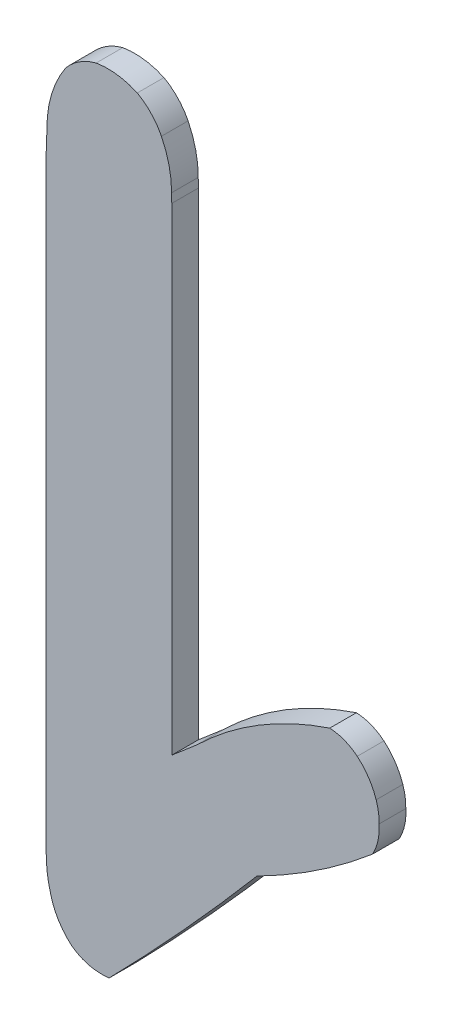
ISO-10303-21;
HEADER;
FILE_DESCRIPTION(('STEP AP214'),'2;1');
FILE_NAME('part.step','',(''),(''),'','','');
FILE_SCHEMA(('AUTOMOTIVE_DESIGN { 1 0 10303 214 1 1 1 1 }'));
ENDSEC;
DATA;
#1=APPLICATION_CONTEXT('core data for automotive mechanical design processes');
#2=APPLICATION_PROTOCOL_DEFINITION('international standard','automotive_design',2000,#1);
#3=PRODUCT_CONTEXT('',#1,'mechanical');
#4=PRODUCT('Part','Part','',(#3));
#5=PRODUCT_RELATED_PRODUCT_CATEGORY('part','',(#4));
#6=PRODUCT_DEFINITION_FORMATION('','',#4);
#7=PRODUCT_DEFINITION_CONTEXT('part definition',#1,'design');
#8=PRODUCT_DEFINITION('design','',#6,#7);
#9=PRODUCT_DEFINITION_SHAPE('','',#8);
#10=(LENGTH_UNIT() NAMED_UNIT(*) SI_UNIT(.MILLI.,.METRE.));
#11=(NAMED_UNIT(*) PLANE_ANGLE_UNIT() SI_UNIT($,.RADIAN.));
#12=(NAMED_UNIT(*) SI_UNIT($,.STERADIAN.) SOLID_ANGLE_UNIT());
#13=UNCERTAINTY_MEASURE_WITH_UNIT(LENGTH_MEASURE(1.E-05),#10,'distance_accuracy_value','');
#14=(GEOMETRIC_REPRESENTATION_CONTEXT(3) GLOBAL_UNCERTAINTY_ASSIGNED_CONTEXT((#13)) GLOBAL_UNIT_ASSIGNED_CONTEXT((#10,
#11,#12)) REPRESENTATION_CONTEXT('',''));
#15=CARTESIAN_POINT('',(0.,0.,0.));
#16=DIRECTION('',(0.,0.,1.));
#17=DIRECTION('',(1.,0.,0.));
#18=AXIS2_PLACEMENT_3D('',#15,#16,#17);
#19=CARTESIAN_POINT('',(-1.32356817484343,-3.51440228783204,0.));
#20=DIRECTION('',(0.,0.,1.));
#21=DIRECTION('',(1.,0.,0.));
#22=AXIS2_PLACEMENT_3D('',#19,#20,#21);
#23=PLANE('',#22);
#24=CARTESIAN_POINT('',(-1.26243654567526,-3.4652377303043,0.));
#25=DIRECTION('',(0.,0.,-1.));
#26=DIRECTION('',(-1.,0.,0.));
#27=AXIS2_PLACEMENT_3D('',#24,#25,#26);
#28=CIRCLE('',#27,0.308146895503402);
#29=CARTESIAN_POINT('',(-1.56203909572244,-3.53729896269462,0.));
#30=VERTEX_POINT('',#29);
#31=CARTESIAN_POINT('',(-1.46146840128563,-3.70048404730135,0.));
#32=VERTEX_POINT('',#31);
#33=EDGE_CURVE('E158',#30,#32,#28,.F.);
#34=ORIENTED_EDGE('',*,*,#33,.F.);
#35=CARTESIAN_POINT('',(-1.05112893558023,-3.38954688872619,0.));
#36=DIRECTION('',(0.,0.,-1.));
#37=DIRECTION('',(-1.,0.,0.));
#38=AXIS2_PLACEMENT_3D('',#35,#36,#37);
#39=CIRCLE('',#38,0.531845717382881);
#40=CARTESIAN_POINT('',(-1.58286365579994,-3.40041217341562,0.));
#41=VERTEX_POINT('',#40);
#42=EDGE_CURVE('E20',#41,#30,#39,.F.);
#43=ORIENTED_EDGE('',*,*,#42,.F.);
#44=DIRECTION('',(0.0222427276221201,-0.999752599930567,0.));
#45=VECTOR('',#44,1.);
#46=CARTESIAN_POINT('',(-1.58373134580317,-3.36141177061429,0.));
#47=LINE('',#46,#45);
#48=CARTESIAN_POINT('',(-1.58373134580317,-3.36141177061427,0.));
#49=VERTEX_POINT('',#48);
#50=EDGE_CURVE('E151',#49,#41,#47,.T.);
#51=ORIENTED_EDGE('',*,*,#50,.F.);
#52=DIRECTION('',(0.,1.,0.));
#53=VECTOR('',#52,1.);
#54=CARTESIAN_POINT('',(-1.58373134580317,-0.502050222938383,0.));
#55=LINE('',#54,#53);
#56=CARTESIAN_POINT('',(-1.58373134580317,-0.502050222938383,0.));
#57=VERTEX_POINT('',#56);
#58=EDGE_CURVE('E304',#49,#57,#55,.T.);
#59=ORIENTED_EDGE('',*,*,#58,.T.);
#60=DIRECTION('',(0.0352404784521863,0.999378861432671,0.));
#61=VECTOR('',#60,1.);
#62=CARTESIAN_POINT('',(-1.58001654797684,-0.396702889837854,0.));
#63=LINE('',#62,#61);
#64=CARTESIAN_POINT('',(-1.58001654797684,-0.396702889837914,0.));
#65=VERTEX_POINT('',#64);
#66=EDGE_CURVE('E294',#57,#65,#63,.T.);
#67=ORIENTED_EDGE('',*,*,#66,.T.);
#68=CARTESIAN_POINT('',(-1.05969997054757,-0.390570609215359,0.));
#69=DIRECTION('',(0.,0.,-1.));
#70=DIRECTION('',(-1.,0.,0.));
#71=AXIS2_PLACEMENT_3D('',#68,#69,#70);
#72=CIRCLE('',#71,0.520352712699135);
#73=CARTESIAN_POINT('',(-1.49086140014506,-0.099251596377554,0.));
#74=VERTEX_POINT('',#73);
#75=EDGE_CURVE('E218',#74,#65,#72,.F.);
#76=ORIENTED_EDGE('',*,*,#75,.F.);
#77=CARTESIAN_POINT('',(-1.27504675214731,-0.2762404123147,0.));
#78=DIRECTION('',(0.,0.,-1.));
#79=DIRECTION('',(-1.,0.,0.));
#80=AXIS2_PLACEMENT_3D('',#77,#78,#79);
#81=CIRCLE('',#80,0.279107512004293);
#82=CARTESIAN_POINT('',(-1.34598428491839,-0.0062980671711876,0.));
#83=VERTEX_POINT('',#82);
#84=EDGE_CURVE('E214',#83,#74,#81,.F.);
#85=ORIENTED_EDGE('',*,*,#84,.F.);
#86=CARTESIAN_POINT('',(-1.2899730389366,-0.341552658756156,0.));
#87=DIRECTION('',(0.,0.,-1.));
#88=DIRECTION('',(-1.,0.,0.));
#89=AXIS2_PLACEMENT_3D('',#86,#87,#88);
#90=CIRCLE('',#89,0.339901310464135);
#91=CARTESIAN_POINT('',(-1.15023884325242,-0.0317022829104376,0.));
#92=VERTEX_POINT('',#91);
#93=EDGE_CURVE('E210',#92,#83,#90,.F.);
#94=ORIENTED_EDGE('',*,*,#93,.F.);
#95=CARTESIAN_POINT('',(-1.29058517764166,-0.279608394921192,0.));
#96=DIRECTION('',(0.,0.,-1.));
#97=DIRECTION('',(-1.,0.,0.));
#98=AXIS2_PLACEMENT_3D('',#95,#96,#97);
#99=CIRCLE('',#98,0.28487634852473);
#100=CARTESIAN_POINT('',(-1.03548684032537,-0.152803930302439,0.));
#101=VERTEX_POINT('',#100);
#102=EDGE_CURVE('E206',#101,#92,#99,.F.);
#103=ORIENTED_EDGE('',*,*,#102,.F.);
#104=CARTESIAN_POINT('',(-1.44912356324474,-0.358154523340133,0.));
#105=DIRECTION('',(0.,0.,-1.));
#106=DIRECTION('',(-1.,0.,0.));
#107=AXIS2_PLACEMENT_3D('',#104,#105,#106);
#108=CIRCLE('',#107,0.461805375248499);
#109=CARTESIAN_POINT('',(-0.987330045146156,-0.361463790712253,0.));
#110=VERTEX_POINT('',#109);
#111=EDGE_CURVE('E201',#110,#101,#108,.F.);
#112=ORIENTED_EDGE('',*,*,#111,.F.);
#113=DIRECTION('',(0.0232210854174442,-0.9997303542416,0.));
#114=VECTOR('',#113,1.);
#115=CARTESIAN_POINT('',(-0.986326778579924,-0.40465712218785,0.));
#116=LINE('',#115,#114);
#117=CARTESIAN_POINT('',(-0.986326778579924,-0.40465712218785,0.));
#118=VERTEX_POINT('',#117);
#119=EDGE_CURVE('E205',#110,#118,#116,.T.);
#120=ORIENTED_EDGE('',*,*,#119,.T.);
#121=DIRECTION('',(0.,1.,0.));
#122=VECTOR('',#121,1.);
#123=CARTESIAN_POINT('',(-0.986326778579924,-2.67716280636695,0.));
#124=LINE('',#123,#122);
#125=CARTESIAN_POINT('',(-0.986326778579923,-2.67716280636695,0.));
#126=VERTEX_POINT('',#125);
#127=EDGE_CURVE('E284',#118,#126,#124,.F.);
#128=ORIENTED_EDGE('',*,*,#127,.T.);
#129=DIRECTION('',(0.7598856857632,0.650056724118897,0.));
#130=VECTOR('',#129,1.);
#131=CARTESIAN_POINT('',(-0.866856711260316,-2.57496016977689,0.));
#132=LINE('',#131,#130);
#133=CARTESIAN_POINT('',(-0.866856711260372,-2.57496016977694,0.));
#134=VERTEX_POINT('',#133);
#135=EDGE_CURVE('E277',#126,#134,#132,.T.);
#136=ORIENTED_EDGE('',*,*,#135,.T.);
#137=CARTESIAN_POINT('',(0.287744797252366,-3.75960348997238,0.));
#138=DIRECTION('',(0.,0.,-1.));
#139=DIRECTION('',(-1.,0.,0.));
#140=AXIS2_PLACEMENT_3D('',#137,#138,#139);
#141=CIRCLE('',#140,1.65423228101243);
#142=CARTESIAN_POINT('',(-0.23517838890952,-2.19019730261428,0.));
#143=VERTEX_POINT('',#142);
#144=EDGE_CURVE('E198',#143,#134,#141,.F.);
#145=ORIENTED_EDGE('',*,*,#144,.F.);
#146=CARTESIAN_POINT('',(-0.244954041898298,-2.40999829922092,0.));
#147=DIRECTION('',(0.,0.,-1.));
#148=DIRECTION('',(-1.,0.,0.));
#149=AXIS2_PLACEMENT_3D('',#146,#147,#148);
#150=CIRCLE('',#149,0.220018275378727);
#151=CARTESIAN_POINT('',(-0.104306317350756,-2.24080533518214,0.));
#152=VERTEX_POINT('',#151);
#153=EDGE_CURVE('E194',#152,#143,#150,.F.);
#154=ORIENTED_EDGE('',*,*,#153,.F.);
#155=CARTESIAN_POINT('',(-0.296636754984562,-2.46721642458803,0.));
#156=DIRECTION('',(0.,0.,-1.));
#157=DIRECTION('',(-1.,0.,0.));
#158=AXIS2_PLACEMENT_3D('',#155,#156,#157);
#159=CIRCLE('',#158,0.29707402889915);
#160=CARTESIAN_POINT('',(-0.014269934296841,-2.37490197706717,0.));
#161=VERTEX_POINT('',#160);
#162=EDGE_CURVE('E190',#161,#152,#159,.F.);
#163=ORIENTED_EDGE('',*,*,#162,.F.);
#164=CARTESIAN_POINT('',(-0.265408994429866,-2.46050758309895,0.));
#165=DIRECTION('',(0.,0.,-1.));
#166=DIRECTION('',(-1.,0.,0.));
#167=AXIS2_PLACEMENT_3D('',#164,#165,#166);
#168=CIRCLE('',#167,0.265328376372688);
#169=CARTESIAN_POINT('',(-0.000169974597434634,-2.46739305090425,0.));
#170=VERTEX_POINT('',#169);
#171=EDGE_CURVE('E186',#170,#161,#168,.F.);
#172=ORIENTED_EDGE('',*,*,#171,.F.);
#173=CARTESIAN_POINT('',(-0.252085028566188,-2.48453586144662,0.));
#174=DIRECTION('',(0.,0.,-1.));
#175=DIRECTION('',(-1.,0.,0.));
#176=AXIS2_PLACEMENT_3D('',#173,#174,#175);
#177=CIRCLE('',#176,0.252497664086961);
#178=CARTESIAN_POINT('',(-0.0314068147136812,-2.60723955454605,0.));
#179=VERTEX_POINT('',#178);
#180=EDGE_CURVE('E182',#179,#170,#177,.F.);
#181=ORIENTED_EDGE('',*,*,#180,.F.);
#182=CARTESIAN_POINT('',(-1.83264567859815,-0.491581808421703,0.));
#183=DIRECTION('',(0.,0.,-1.));
#184=DIRECTION('',(-1.,0.,0.));
#185=AXIS2_PLACEMENT_3D('',#182,#183,#184);
#186=CIRCLE('',#185,2.77857322082823);
#187=CARTESIAN_POINT('',(-0.581047758790502,-2.97230182298137,0.));
#188=VERTEX_POINT('',#187);
#189=EDGE_CURVE('E178',#188,#179,#186,.F.);
#190=ORIENTED_EDGE('',*,*,#189,.F.);
#191=CARTESIAN_POINT('',(-11.9325819547259,6.66693556379146,0.));
#192=DIRECTION('',(0.,0.,-1.));
#193=DIRECTION('',(-1.,0.,0.));
#194=AXIS2_PLACEMENT_3D('',#191,#192,#193);
#195=CIRCLE('',#194,14.8920188691812);
#196=CARTESIAN_POINT('',(-1.28413425687579,-3.7437698698571,0.));
#197=VERTEX_POINT('',#196);
#198=EDGE_CURVE('E173',#197,#188,#195,.F.);
#199=ORIENTED_EDGE('',*,*,#198,.F.);
#200=DIRECTION('',(-0.996718292328276,-0.0809484140561453,0.));
#201=VECTOR('',#200,1.);
#202=CARTESIAN_POINT('',(-1.304633433202,-3.74543470918618,0.));
#203=LINE('',#202,#201);
#204=CARTESIAN_POINT('',(-1.304633433202,-3.74543470918618,0.));
#205=VERTEX_POINT('',#204);
#206=EDGE_CURVE('E177',#197,#205,#203,.T.);
#207=ORIENTED_EDGE('',*,*,#206,.T.);
#208=DIRECTION('',(-0.999685617936159,-0.0250731986710944,0.));
#209=VECTOR('',#208,1.);
#210=CARTESIAN_POINT('',(-1.32675952828435,-3.7459896556292,0.));
#211=LINE('',#210,#209);
#212=CARTESIAN_POINT('',(-1.32675952828446,-3.7459896556292,0.));
#213=VERTEX_POINT('',#212);
#214=EDGE_CURVE('E268',#205,#213,#211,.T.);
#215=ORIENTED_EDGE('',*,*,#214,.T.);
#216=CARTESIAN_POINT('',(-1.32356817484343,-3.51440228783204,0.));
#217=DIRECTION('',(0.,0.,-1.));
#218=DIRECTION('',(-1.,0.,0.));
#219=AXIS2_PLACEMENT_3D('',#216,#217,#218);
#220=CIRCLE('',#219,0.231609355726417);
#221=EDGE_CURVE('E168',#32,#213,#220,.F.);
#222=ORIENTED_EDGE('',*,*,#221,.F.);
#223=EDGE_LOOP('',(#34,#43,#51,#59,#67,#76,#85,#94,#103,#112,#120,#128,#136,#145,#154,#163,#172,
#181,#190,#199,#207,#215,#222));
#224=FACE_BOUND('',#223,.T.);
#225=ADVANCED_FACE('F17',(#224),#23,.F.);
#226=CARTESIAN_POINT('',(-1.32356817484343,-3.51440228783204,0.12677429857786));
#227=DIRECTION('',(0.,0.,-1.));
#228=DIRECTION('',(-1.,0.,0.));
#229=AXIS2_PLACEMENT_3D('',#226,#227,#228);
#230=CYLINDRICAL_SURFACE('',#229,0.231609355726417);
#231=CARTESIAN_POINT('',(-1.32356817484343,-3.51440228783204,0.12677429857786));
#232=DIRECTION('',(0.,0.,-1.));
#233=DIRECTION('',(-1.,0.,0.));
#234=AXIS2_PLACEMENT_3D('',#231,#232,#233);
#235=CIRCLE('',#234,0.231609355726417);
#236=CARTESIAN_POINT('',(-1.46146840128563,-3.70048404730135,0.12677429857786));
#237=VERTEX_POINT('',#236);
#238=CARTESIAN_POINT('',(-1.32675952828446,-3.7459896556292,0.12677429857786));
#239=VERTEX_POINT('',#238);
#240=EDGE_CURVE('E164',#237,#239,#235,.F.);
#241=ORIENTED_EDGE('',*,*,#240,.F.);
#242=DIRECTION('',(0.,0.,-1.));
#243=VECTOR('',#242,1.);
#244=CARTESIAN_POINT('',(-1.46146840128567,-3.70048404730132,0.12677429857786));
#245=LINE('',#244,#243);
#246=EDGE_CURVE('E165',#32,#237,#245,.F.);
#247=ORIENTED_EDGE('',*,*,#246,.F.);
#248=ORIENTED_EDGE('',*,*,#221,.T.);
#249=DIRECTION('',(0.,0.,1.));
#250=VECTOR('',#249,1.);
#251=CARTESIAN_POINT('',(-1.32675952828435,-3.7459896556292,0.12677429857786));
#252=LINE('',#251,#250);
#253=EDGE_CURVE('E170',#213,#239,#252,.T.);
#254=ORIENTED_EDGE('',*,*,#253,.T.);
#255=EDGE_LOOP('',(#241,#247,#248,#254));
#256=FACE_BOUND('',#255,.T.);
#257=ADVANCED_FACE('F475',(#256),#230,.T.);
#258=CARTESIAN_POINT('',(-1.32675952828435,-3.7459896556292,0.12677429857786));
#259=DIRECTION('',(-0.0250731986710944,0.999685617936159,0.));
#260=DIRECTION('',(-0.999685617936159,-0.0250731986710944,0.));
#261=AXIS2_PLACEMENT_3D('',#258,#259,#260);
#262=PLANE('',#261);
#263=DIRECTION('',(0.,0.,1.));
#264=VECTOR('',#263,1.);
#265=CARTESIAN_POINT('',(-1.304633433202,-3.74543470918618,0.12677429857786));
#266=LINE('',#265,#264);
#267=CARTESIAN_POINT('',(-1.304633433202,-3.74543470918618,0.12677429857786));
#268=VERTEX_POINT('',#267);
#269=EDGE_CURVE('E270',#205,#268,#266,.T.);
#270=ORIENTED_EDGE('',*,*,#269,.T.);
#271=DIRECTION('',(0.999685617936163,0.025073198670949,0.));
#272=VECTOR('',#271,1.);
#273=CARTESIAN_POINT('',(-1.32675952828435,-3.7459896556292,0.12677429857786));
#274=LINE('',#273,#272);
#275=EDGE_CURVE('E223',#239,#268,#274,.T.);
#276=ORIENTED_EDGE('',*,*,#275,.F.);
#277=ORIENTED_EDGE('',*,*,#253,.F.);
#278=ORIENTED_EDGE('',*,*,#214,.F.);
#279=EDGE_LOOP('',(#270,#276,#277,#278));
#280=FACE_BOUND('',#279,.T.);
#281=ADVANCED_FACE('F473',(#280),#262,.F.);
#282=CARTESIAN_POINT('',(-1.304633433202,-3.74543470918618,0.12677429857786));
#283=DIRECTION('',(-0.0809484140561453,0.996718292328276,0.));
#284=DIRECTION('',(-0.996718292328276,-0.0809484140561453,0.));
#285=AXIS2_PLACEMENT_3D('',#282,#283,#284);
#286=PLANE('',#285);
#287=DIRECTION('',(0.,0.,-1.));
#288=VECTOR('',#287,1.);
#289=CARTESIAN_POINT('',(-1.28413425687576,-3.74376986985707,0.12677429857786));
#290=LINE('',#289,#288);
#291=CARTESIAN_POINT('',(-1.28413425687579,-3.7437698698571,0.12677429857786));
#292=VERTEX_POINT('',#291);
#293=EDGE_CURVE('E176',#292,#197,#290,.T.);
#294=ORIENTED_EDGE('',*,*,#293,.F.);
#295=DIRECTION('',(0.996718292328308,0.080948414055757,0.));
#296=VECTOR('',#295,1.);
#297=CARTESIAN_POINT('',(-1.304633433202,-3.74543470918618,0.12677429857786));
#298=LINE('',#297,#296);
#299=EDGE_CURVE('E228',#268,#292,#298,.T.);
#300=ORIENTED_EDGE('',*,*,#299,.F.);
#301=ORIENTED_EDGE('',*,*,#269,.F.);
#302=ORIENTED_EDGE('',*,*,#206,.F.);
#303=EDGE_LOOP('',(#294,#300,#301,#302));
#304=FACE_BOUND('',#303,.T.);
#305=ADVANCED_FACE('F468',(#304),#286,.F.);
#306=CARTESIAN_POINT('',(-11.9325819547259,6.66693556379146,0.12677429857786));
#307=DIRECTION('',(0.,0.,-1.));
#308=DIRECTION('',(-1.,0.,0.));
#309=AXIS2_PLACEMENT_3D('',#306,#307,#308);
#310=CYLINDRICAL_SURFACE('',#309,14.8920188691812);
#311=CARTESIAN_POINT('',(-11.9325819547259,6.66693556379146,0.12677429857786));
#312=DIRECTION('',(0.,0.,-1.));
#313=DIRECTION('',(-1.,0.,0.));
#314=AXIS2_PLACEMENT_3D('',#311,#312,#313);
#315=CIRCLE('',#314,14.8920188691812);
#316=CARTESIAN_POINT('',(-0.581047758790502,-2.97230182298137,0.12677429857786));
#317=VERTEX_POINT('',#316);
#318=EDGE_CURVE('E224',#292,#317,#315,.F.);
#319=ORIENTED_EDGE('',*,*,#318,.F.);
#320=ORIENTED_EDGE('',*,*,#293,.T.);
#321=ORIENTED_EDGE('',*,*,#198,.T.);
#322=DIRECTION('',(0.,0.,-1.));
#323=VECTOR('',#322,1.);
#324=CARTESIAN_POINT('',(-0.581047758790427,-2.97230182298134,0.12677429857786));
#325=LINE('',#324,#323);
#326=EDGE_CURVE('E181',#317,#188,#325,.T.);
#327=ORIENTED_EDGE('',*,*,#326,.F.);
#328=EDGE_LOOP('',(#319,#320,#321,#327));
#329=FACE_BOUND('',#328,.T.);
#330=ADVANCED_FACE('F465',(#329),#310,.T.);
#331=CARTESIAN_POINT('',(-1.83264567859815,-0.491581808421703,0.12677429857786));
#332=DIRECTION('',(0.,0.,-1.));
#333=DIRECTION('',(-1.,0.,0.));
#334=AXIS2_PLACEMENT_3D('',#331,#332,#333);
#335=CYLINDRICAL_SURFACE('',#334,2.77857322082823);
#336=CARTESIAN_POINT('',(-1.83264567859815,-0.491581808421703,0.12677429857786));
#337=DIRECTION('',(0.,0.,-1.));
#338=DIRECTION('',(-1.,0.,0.));
#339=AXIS2_PLACEMENT_3D('',#336,#337,#338);
#340=CIRCLE('',#339,2.77857322082823);
#341=CARTESIAN_POINT('',(-0.0314068147136812,-2.60723955454605,0.12677429857786));
#342=VERTEX_POINT('',#341);
#343=EDGE_CURVE('E227',#317,#342,#340,.F.);
#344=ORIENTED_EDGE('',*,*,#343,.F.);
#345=ORIENTED_EDGE('',*,*,#326,.T.);
#346=ORIENTED_EDGE('',*,*,#189,.T.);
#347=DIRECTION('',(0.,0.,-1.));
#348=VECTOR('',#347,1.);
#349=CARTESIAN_POINT('',(-0.0314068147136817,-2.60723955454605,0.12677429857786));
#350=LINE('',#349,#348);
#351=EDGE_CURVE('E185',#342,#179,#350,.T.);
#352=ORIENTED_EDGE('',*,*,#351,.F.);
#353=EDGE_LOOP('',(#344,#345,#346,#352));
#354=FACE_BOUND('',#353,.T.);
#355=ADVANCED_FACE('F461',(#354),#335,.T.);
#356=CARTESIAN_POINT('',(-0.252085028566188,-2.48453586144662,0.12677429857786));
#357=DIRECTION('',(0.,0.,-1.));
#358=DIRECTION('',(-1.,0.,0.));
#359=AXIS2_PLACEMENT_3D('',#356,#357,#358);
#360=CYLINDRICAL_SURFACE('',#359,0.252497664086961);
#361=CARTESIAN_POINT('',(-0.252085028566188,-2.48453586144662,0.12677429857786));
#362=DIRECTION('',(0.,0.,-1.));
#363=DIRECTION('',(-1.,0.,0.));
#364=AXIS2_PLACEMENT_3D('',#361,#362,#363);
#365=CIRCLE('',#364,0.252497664086961);
#366=CARTESIAN_POINT('',(-0.000169974597434634,-2.46739305090425,0.12677429857786));
#367=VERTEX_POINT('',#366);
#368=EDGE_CURVE('E231',#342,#367,#365,.F.);
#369=ORIENTED_EDGE('',*,*,#368,.F.);
#370=ORIENTED_EDGE('',*,*,#351,.T.);
#371=ORIENTED_EDGE('',*,*,#180,.T.);
#372=DIRECTION('',(0.,0.,-1.));
#373=VECTOR('',#372,1.);
#374=CARTESIAN_POINT('',(-0.000169974597434824,-2.46739305090426,0.12677429857786));
#375=LINE('',#374,#373);
#376=EDGE_CURVE('E189',#367,#170,#375,.T.);
#377=ORIENTED_EDGE('',*,*,#376,.F.);
#378=EDGE_LOOP('',(#369,#370,#371,#377));
#379=FACE_BOUND('',#378,.T.);
#380=ADVANCED_FACE('F458',(#379),#360,.T.);
#381=CARTESIAN_POINT('',(-0.265408994429866,-2.46050758309895,0.12677429857786));
#382=DIRECTION('',(0.,0.,-1.));
#383=DIRECTION('',(-1.,0.,0.));
#384=AXIS2_PLACEMENT_3D('',#381,#382,#383);
#385=CYLINDRICAL_SURFACE('',#384,0.265328376372688);
#386=CARTESIAN_POINT('',(-0.265408994429866,-2.46050758309895,0.12677429857786));
#387=DIRECTION('',(0.,0.,-1.));
#388=DIRECTION('',(-1.,0.,0.));
#389=AXIS2_PLACEMENT_3D('',#386,#387,#388);
#390=CIRCLE('',#389,0.265328376372688);
#391=CARTESIAN_POINT('',(-0.014269934296841,-2.37490197706717,0.12677429857786));
#392=VERTEX_POINT('',#391);
#393=EDGE_CURVE('E234',#367,#392,#390,.F.);
#394=ORIENTED_EDGE('',*,*,#393,.F.);
#395=ORIENTED_EDGE('',*,*,#376,.T.);
#396=ORIENTED_EDGE('',*,*,#171,.T.);
#397=DIRECTION('',(0.,0.,-1.));
#398=VECTOR('',#397,1.);
#399=CARTESIAN_POINT('',(-0.0142699342968644,-2.3749019770671,0.12677429857786));
#400=LINE('',#399,#398);
#401=EDGE_CURVE('E193',#392,#161,#400,.T.);
#402=ORIENTED_EDGE('',*,*,#401,.F.);
#403=EDGE_LOOP('',(#394,#395,#396,#402));
#404=FACE_BOUND('',#403,.T.);
#405=ADVANCED_FACE('F455',(#404),#385,.T.);
#406=CARTESIAN_POINT('',(-0.296636754984562,-2.46721642458803,0.12677429857786));
#407=DIRECTION('',(0.,0.,-1.));
#408=DIRECTION('',(-1.,0.,0.));
#409=AXIS2_PLACEMENT_3D('',#406,#407,#408);
#410=CYLINDRICAL_SURFACE('',#409,0.29707402889915);
#411=CARTESIAN_POINT('',(-0.296636754984562,-2.46721642458803,0.12677429857786));
#412=DIRECTION('',(0.,0.,-1.));
#413=DIRECTION('',(-1.,0.,0.));
#414=AXIS2_PLACEMENT_3D('',#411,#412,#413);
#415=CIRCLE('',#414,0.29707402889915);
#416=CARTESIAN_POINT('',(-0.104306317350756,-2.24080533518214,0.12677429857786));
#417=VERTEX_POINT('',#416);
#418=EDGE_CURVE('E237',#392,#417,#415,.F.);
#419=ORIENTED_EDGE('',*,*,#418,.F.);
#420=ORIENTED_EDGE('',*,*,#401,.T.);
#421=ORIENTED_EDGE('',*,*,#162,.T.);
#422=DIRECTION('',(0.,0.,-1.));
#423=VECTOR('',#422,1.);
#424=CARTESIAN_POINT('',(-0.104306317350702,-2.24080533518218,0.12677429857786));
#425=LINE('',#424,#423);
#426=EDGE_CURVE('E197',#417,#152,#425,.T.);
#427=ORIENTED_EDGE('',*,*,#426,.F.);
#428=EDGE_LOOP('',(#419,#420,#421,#427));
#429=FACE_BOUND('',#428,.T.);
#430=ADVANCED_FACE('F452',(#429),#410,.T.);
#431=CARTESIAN_POINT('',(-0.244954041898298,-2.40999829922092,0.12677429857786));
#432=DIRECTION('',(0.,0.,-1.));
#433=DIRECTION('',(-1.,0.,0.));
#434=AXIS2_PLACEMENT_3D('',#431,#432,#433);
#435=CYLINDRICAL_SURFACE('',#434,0.220018275378727);
#436=CARTESIAN_POINT('',(-0.244954041898298,-2.40999829922092,0.12677429857786));
#437=DIRECTION('',(0.,0.,-1.));
#438=DIRECTION('',(-1.,0.,0.));
#439=AXIS2_PLACEMENT_3D('',#436,#437,#438);
#440=CIRCLE('',#439,0.220018275378727);
#441=CARTESIAN_POINT('',(-0.23517838890952,-2.19019730261428,0.12677429857786));
#442=VERTEX_POINT('',#441);
#443=EDGE_CURVE('E240',#417,#442,#440,.F.);
#444=ORIENTED_EDGE('',*,*,#443,.F.);
#445=ORIENTED_EDGE('',*,*,#426,.T.);
#446=ORIENTED_EDGE('',*,*,#153,.T.);
#447=DIRECTION('',(0.,0.,-1.));
#448=VECTOR('',#447,1.);
#449=CARTESIAN_POINT('',(-0.235178388909523,-2.19019730261428,0.12677429857786));
#450=LINE('',#449,#448);
#451=EDGE_CURVE('E200',#442,#143,#450,.T.);
#452=ORIENTED_EDGE('',*,*,#451,.F.);
#453=EDGE_LOOP('',(#444,#445,#446,#452));
#454=FACE_BOUND('',#453,.T.);
#455=ADVANCED_FACE('F449',(#454),#435,.T.);
#456=CARTESIAN_POINT('',(0.287744797252366,-3.75960348997238,0.12677429857786));
#457=DIRECTION('',(0.,0.,-1.));
#458=DIRECTION('',(-1.,0.,0.));
#459=AXIS2_PLACEMENT_3D('',#456,#457,#458);
#460=CYLINDRICAL_SURFACE('',#459,1.65423228101243);
#461=CARTESIAN_POINT('',(0.287744797252366,-3.75960348997238,0.12677429857786));
#462=DIRECTION('',(0.,0.,-1.));
#463=DIRECTION('',(-1.,0.,0.));
#464=AXIS2_PLACEMENT_3D('',#461,#462,#463);
#465=CIRCLE('',#464,1.65423228101243);
#466=CARTESIAN_POINT('',(-0.866856711260371,-2.57496016977694,0.12677429857786));
#467=VERTEX_POINT('',#466);
#468=EDGE_CURVE('E243',#442,#467,#465,.F.);
#469=ORIENTED_EDGE('',*,*,#468,.F.);
#470=ORIENTED_EDGE('',*,*,#451,.T.);
#471=ORIENTED_EDGE('',*,*,#144,.T.);
#472=DIRECTION('',(0.,0.,1.));
#473=VECTOR('',#472,1.);
#474=CARTESIAN_POINT('',(-0.866856711260316,-2.57496016977689,0.12677429857786));
#475=LINE('',#474,#473);
#476=EDGE_CURVE('E281',#134,#467,#475,.T.);
#477=ORIENTED_EDGE('',*,*,#476,.T.);
#478=EDGE_LOOP('',(#469,#470,#471,#477));
#479=FACE_BOUND('',#478,.T.);
#480=ADVANCED_FACE('F446',(#479),#460,.T.);
#481=CARTESIAN_POINT('',(-0.866856711260316,-2.57496016977689,0.12677429857786));
#482=DIRECTION('',(0.650056724118897,-0.7598856857632,0.));
#483=DIRECTION('',(0.7598856857632,0.650056724118897,0.));
#484=AXIS2_PLACEMENT_3D('',#481,#482,#483);
#485=PLANE('',#484);
#486=DIRECTION('',(0.,0.,1.));
#487=VECTOR('',#486,1.);
#488=CARTESIAN_POINT('',(-0.986326778579924,-2.67716280636695,0.12677429857786));
#489=LINE('',#488,#487);
#490=CARTESIAN_POINT('',(-0.986326778579924,-2.67716280636695,0.12677429857786));
#491=VERTEX_POINT('',#490);
#492=EDGE_CURVE('E280',#126,#491,#489,.T.);
#493=ORIENTED_EDGE('',*,*,#492,.T.);
#494=DIRECTION('',(-0.759885685763214,-0.65005672411888,0.));
#495=VECTOR('',#494,1.);
#496=CARTESIAN_POINT('',(-0.866856711260316,-2.57496016977689,0.12677429857786));
#497=LINE('',#496,#495);
#498=EDGE_CURVE('E246',#467,#491,#497,.T.);
#499=ORIENTED_EDGE('',*,*,#498,.F.);
#500=ORIENTED_EDGE('',*,*,#476,.F.);
#501=ORIENTED_EDGE('',*,*,#135,.F.);
#502=EDGE_LOOP('',(#493,#499,#500,#501));
#503=FACE_BOUND('',#502,.T.);
#504=ADVANCED_FACE('F443',(#503),#485,.F.);
#505=CARTESIAN_POINT('',(-0.986326778579924,-2.67716280636695,0.12677429857786));
#506=DIRECTION('',(-1.,0.,0.));
#507=DIRECTION('',(0.,0.,1.));
#508=AXIS2_PLACEMENT_3D('',#505,#506,#507);
#509=PLANE('',#508);
#510=DIRECTION('',(0.,0.,1.));
#511=VECTOR('',#510,1.);
#512=CARTESIAN_POINT('',(-0.986326778579924,-0.40465712218785,0.12677429857786));
#513=LINE('',#512,#511);
#514=CARTESIAN_POINT('',(-0.986326778579919,-0.404657122188806,0.12677429857786));
#515=VERTEX_POINT('',#514);
#516=EDGE_CURVE('E287',#118,#515,#513,.T.);
#517=ORIENTED_EDGE('',*,*,#516,.T.);
#518=DIRECTION('',(0.,1.,0.));
#519=VECTOR('',#518,1.);
#520=CARTESIAN_POINT('',(-0.986326778579924,-3.51440228783204,0.12677429857786));
#521=LINE('',#520,#519);
#522=EDGE_CURVE('E334',#491,#515,#521,.T.);
#523=ORIENTED_EDGE('',*,*,#522,.F.);
#524=ORIENTED_EDGE('',*,*,#492,.F.);
#525=ORIENTED_EDGE('',*,*,#127,.F.);
#526=EDGE_LOOP('',(#517,#523,#524,#525));
#527=FACE_BOUND('',#526,.T.);
#528=ADVANCED_FACE('F438',(#527),#509,.F.);
#529=CARTESIAN_POINT('',(-0.986326778579924,-0.40465712218785,0.12677429857786));
#530=DIRECTION('',(-0.9997303542416,-0.0232210854174442,0.));
#531=DIRECTION('',(0.0232210854174442,-0.9997303542416,0.));
#532=AXIS2_PLACEMENT_3D('',#529,#530,#531);
#533=PLANE('',#532);
#534=DIRECTION('',(0.,0.,-1.));
#535=VECTOR('',#534,1.);
#536=CARTESIAN_POINT('',(-0.987330045146156,-0.361463790712231,0.12677429857786));
#537=LINE('',#536,#535);
#538=CARTESIAN_POINT('',(-0.987330045146156,-0.36146379071226,0.12677429857786));
#539=VERTEX_POINT('',#538);
#540=EDGE_CURVE('E204',#539,#110,#537,.T.);
#541=ORIENTED_EDGE('',*,*,#540,.F.);
#542=DIRECTION('',(-0.0232210854174567,0.9997303542416,0.));
#543=VECTOR('',#542,1.);
#544=CARTESIAN_POINT('',(-0.986326778579924,-0.40465712218785,0.12677429857786));
#545=LINE('',#544,#543);
#546=EDGE_CURVE('E251',#515,#539,#545,.T.);
#547=ORIENTED_EDGE('',*,*,#546,.F.);
#548=ORIENTED_EDGE('',*,*,#516,.F.);
#549=ORIENTED_EDGE('',*,*,#119,.F.);
#550=EDGE_LOOP('',(#541,#547,#548,#549));
#551=FACE_BOUND('',#550,.T.);
#552=ADVANCED_FACE('F434',(#551),#533,.F.);
#553=CARTESIAN_POINT('',(-1.44912356324474,-0.358154523340133,0.12677429857786));
#554=DIRECTION('',(0.,0.,-1.));
#555=DIRECTION('',(-1.,0.,0.));
#556=AXIS2_PLACEMENT_3D('',#553,#554,#555);
#557=CYLINDRICAL_SURFACE('',#556,0.461805375248499);
#558=CARTESIAN_POINT('',(-1.44912356324474,-0.358154523340133,0.12677429857786));
#559=DIRECTION('',(0.,0.,-1.));
#560=DIRECTION('',(-1.,0.,0.));
#561=AXIS2_PLACEMENT_3D('',#558,#559,#560);
#562=CIRCLE('',#561,0.461805375248499);
#563=CARTESIAN_POINT('',(-1.03548684032537,-0.152803930302439,0.12677429857786));
#564=VERTEX_POINT('',#563);
#565=EDGE_CURVE('E247',#539,#564,#562,.F.);
#566=ORIENTED_EDGE('',*,*,#565,.F.);
#567=ORIENTED_EDGE('',*,*,#540,.T.);
#568=ORIENTED_EDGE('',*,*,#111,.T.);
#569=DIRECTION('',(0.,0.,-1.));
#570=VECTOR('',#569,1.);
#571=CARTESIAN_POINT('',(-1.03548684032537,-0.152803930302439,0.12677429857786));
#572=LINE('',#571,#570);
#573=EDGE_CURVE('E209',#564,#101,#572,.T.);
#574=ORIENTED_EDGE('',*,*,#573,.F.);
#575=EDGE_LOOP('',(#566,#567,#568,#574));
#576=FACE_BOUND('',#575,.T.);
#577=ADVANCED_FACE('F430',(#576),#557,.T.);
#578=CARTESIAN_POINT('',(-1.29058517764166,-0.279608394921192,0.12677429857786));
#579=DIRECTION('',(0.,0.,-1.));
#580=DIRECTION('',(-1.,0.,0.));
#581=AXIS2_PLACEMENT_3D('',#578,#579,#580);
#582=CYLINDRICAL_SURFACE('',#581,0.28487634852473);
#583=CARTESIAN_POINT('',(-1.29058517764166,-0.279608394921192,0.12677429857786));
#584=DIRECTION('',(0.,0.,-1.));
#585=DIRECTION('',(-1.,0.,0.));
#586=AXIS2_PLACEMENT_3D('',#583,#584,#585);
#587=CIRCLE('',#586,0.28487634852473);
#588=CARTESIAN_POINT('',(-1.15023884325242,-0.0317022829104376,0.12677429857786));
#589=VERTEX_POINT('',#588);
#590=EDGE_CURVE('E250',#564,#589,#587,.F.);
#591=ORIENTED_EDGE('',*,*,#590,.F.);
#592=ORIENTED_EDGE('',*,*,#573,.T.);
#593=ORIENTED_EDGE('',*,*,#102,.T.);
#594=DIRECTION('',(0.,0.,-1.));
#595=VECTOR('',#594,1.);
#596=CARTESIAN_POINT('',(-1.15023884325242,-0.0317022829104397,0.12677429857786));
#597=LINE('',#596,#595);
#598=EDGE_CURVE('E213',#589,#92,#597,.T.);
#599=ORIENTED_EDGE('',*,*,#598,.F.);
#600=EDGE_LOOP('',(#591,#592,#593,#599));
#601=FACE_BOUND('',#600,.T.);
#602=ADVANCED_FACE('F427',(#601),#582,.T.);
#603=CARTESIAN_POINT('',(-1.2899730389366,-0.341552658756156,0.12677429857786));
#604=DIRECTION('',(0.,0.,-1.));
#605=DIRECTION('',(-1.,0.,0.));
#606=AXIS2_PLACEMENT_3D('',#603,#604,#605);
#607=CYLINDRICAL_SURFACE('',#606,0.339901310464135);
#608=CARTESIAN_POINT('',(-1.2899730389366,-0.341552658756156,0.12677429857786));
#609=DIRECTION('',(0.,0.,-1.));
#610=DIRECTION('',(-1.,0.,0.));
#611=AXIS2_PLACEMENT_3D('',#608,#609,#610);
#612=CIRCLE('',#611,0.339901310464135);
#613=CARTESIAN_POINT('',(-1.34598428491839,-0.0062980671711876,0.12677429857786));
#614=VERTEX_POINT('',#613);
#615=EDGE_CURVE('E254',#589,#614,#612,.F.);
#616=ORIENTED_EDGE('',*,*,#615,.F.);
#617=ORIENTED_EDGE('',*,*,#598,.T.);
#618=ORIENTED_EDGE('',*,*,#93,.T.);
#619=DIRECTION('',(0.,0.,-1.));
#620=VECTOR('',#619,1.);
#621=CARTESIAN_POINT('',(-1.34598428491839,-0.00629806717118876,0.12677429857786));
#622=LINE('',#621,#620);
#623=EDGE_CURVE('E217',#614,#83,#622,.T.);
#624=ORIENTED_EDGE('',*,*,#623,.F.);
#625=EDGE_LOOP('',(#616,#617,#618,#624));
#626=FACE_BOUND('',#625,.T.);
#627=ADVANCED_FACE('F425',(#626),#607,.T.);
#628=CARTESIAN_POINT('',(-1.27504675214731,-0.2762404123147,0.12677429857786));
#629=DIRECTION('',(0.,0.,-1.));
#630=DIRECTION('',(-1.,0.,0.));
#631=AXIS2_PLACEMENT_3D('',#628,#629,#630);
#632=CYLINDRICAL_SURFACE('',#631,0.279107512004293);
#633=CARTESIAN_POINT('',(-1.27504675214731,-0.2762404123147,0.12677429857786));
#634=DIRECTION('',(0.,0.,-1.));
#635=DIRECTION('',(-1.,0.,0.));
#636=AXIS2_PLACEMENT_3D('',#633,#634,#635);
#637=CIRCLE('',#636,0.279107512004293);
#638=CARTESIAN_POINT('',(-1.49086140014506,-0.099251596377554,0.12677429857786));
#639=VERTEX_POINT('',#638);
#640=EDGE_CURVE('E257',#614,#639,#637,.F.);
#641=ORIENTED_EDGE('',*,*,#640,.F.);
#642=ORIENTED_EDGE('',*,*,#623,.T.);
#643=ORIENTED_EDGE('',*,*,#84,.T.);
#644=DIRECTION('',(0.,0.,-1.));
#645=VECTOR('',#644,1.);
#646=CARTESIAN_POINT('',(-1.49086140014505,-0.0992515963775359,0.12677429857786));
#647=LINE('',#646,#645);
#648=EDGE_CURVE('E220',#639,#74,#647,.T.);
#649=ORIENTED_EDGE('',*,*,#648,.F.);
#650=EDGE_LOOP('',(#641,#642,#643,#649));
#651=FACE_BOUND('',#650,.T.);
#652=ADVANCED_FACE('F419',(#651),#632,.T.);
#653=CARTESIAN_POINT('',(-1.05969997054757,-0.390570609215359,0.12677429857786));
#654=DIRECTION('',(0.,0.,-1.));
#655=DIRECTION('',(-1.,0.,0.));
#656=AXIS2_PLACEMENT_3D('',#653,#654,#655);
#657=CYLINDRICAL_SURFACE('',#656,0.520352712699135);
#658=CARTESIAN_POINT('',(-1.05969997054757,-0.390570609215359,0.12677429857786));
#659=DIRECTION('',(0.,0.,-1.));
#660=DIRECTION('',(-1.,0.,0.));
#661=AXIS2_PLACEMENT_3D('',#658,#659,#660);
#662=CIRCLE('',#661,0.520352712699135);
#663=CARTESIAN_POINT('',(-1.58001654797684,-0.396702889837915,0.12677429857786));
#664=VERTEX_POINT('',#663);
#665=EDGE_CURVE('E260',#639,#664,#662,.F.);
#666=ORIENTED_EDGE('',*,*,#665,.F.);
#667=ORIENTED_EDGE('',*,*,#648,.T.);
#668=ORIENTED_EDGE('',*,*,#75,.T.);
#669=DIRECTION('',(0.,0.,1.));
#670=VECTOR('',#669,1.);
#671=CARTESIAN_POINT('',(-1.58001654797684,-0.396702889837854,0.12677429857786));
#672=LINE('',#671,#670);
#673=EDGE_CURVE('E298',#65,#664,#672,.T.);
#674=ORIENTED_EDGE('',*,*,#673,.T.);
#675=EDGE_LOOP('',(#666,#667,#668,#674));
#676=FACE_BOUND('',#675,.T.);
#677=ADVANCED_FACE('F421',(#676),#657,.T.);
#678=CARTESIAN_POINT('',(-1.58001654797684,-0.396702889837854,0.12677429857786));
#679=DIRECTION('',(0.999378861432671,-0.0352404784521863,0.));
#680=DIRECTION('',(0.0352404784521863,0.999378861432671,0.));
#681=AXIS2_PLACEMENT_3D('',#678,#679,#680);
#682=PLANE('',#681);
#683=DIRECTION('',(0.,0.,-1.));
#684=VECTOR('',#683,1.);
#685=CARTESIAN_POINT('',(-1.58373134580317,-0.502050222938383,0.12677429857786));
#686=LINE('',#685,#684);
#687=CARTESIAN_POINT('',(-1.58373134580317,-0.502050222938285,0.12677429857786));
#688=VERTEX_POINT('',#687);
#689=EDGE_CURVE('E297',#57,#688,#686,.F.);
#690=ORIENTED_EDGE('',*,*,#689,.T.);
#691=DIRECTION('',(-0.0352404784522418,-0.999378861432669,0.));
#692=VECTOR('',#691,1.);
#693=CARTESIAN_POINT('',(-1.58001654797684,-0.396702889837854,0.12677429857786));
#694=LINE('',#693,#692);
#695=EDGE_CURVE('E263',#664,#688,#694,.T.);
#696=ORIENTED_EDGE('',*,*,#695,.F.);
#697=ORIENTED_EDGE('',*,*,#673,.F.);
#698=ORIENTED_EDGE('',*,*,#66,.F.);
#699=EDGE_LOOP('',(#690,#696,#697,#698));
#700=FACE_BOUND('',#699,.T.);
#701=ADVANCED_FACE('F414',(#700),#682,.F.);
#702=CARTESIAN_POINT('',(-1.58373134580317,-0.502050222938383,0.12677429857786));
#703=DIRECTION('',(1.,0.,0.));
#704=DIRECTION('',(0.,0.,-1.));
#705=AXIS2_PLACEMENT_3D('',#702,#703,#704);
#706=PLANE('',#705);
#707=DIRECTION('',(0.,0.,1.));
#708=VECTOR('',#707,1.);
#709=CARTESIAN_POINT('',(-1.58373134580317,-3.36141177061429,0.12677429857786));
#710=LINE('',#709,#708);
#711=CARTESIAN_POINT('',(-1.58373134580317,-3.36141177061425,0.12677429857786));
#712=VERTEX_POINT('',#711);
#713=EDGE_CURVE('E307',#49,#712,#710,.T.);
#714=ORIENTED_EDGE('',*,*,#713,.T.);
#715=DIRECTION('',(0.,1.,0.));
#716=VECTOR('',#715,1.);
#717=CARTESIAN_POINT('',(-1.58373134580317,-3.51440228783204,0.12677429857786));
#718=LINE('',#717,#716);
#719=EDGE_CURVE('E358',#688,#712,#718,.F.);
#720=ORIENTED_EDGE('',*,*,#719,.F.);
#721=ORIENTED_EDGE('',*,*,#689,.F.);
#722=ORIENTED_EDGE('',*,*,#58,.F.);
#723=EDGE_LOOP('',(#714,#720,#721,#722));
#724=FACE_BOUND('',#723,.T.);
#725=ADVANCED_FACE('F411',(#724),#706,.F.);
#726=CARTESIAN_POINT('',(-1.58373134580317,-3.36141177061429,0.12677429857786));
#727=DIRECTION('',(0.999752599930567,0.0222427276220995,0.));
#728=DIRECTION('',(-0.0222427276220995,0.999752599930567,0.));
#729=AXIS2_PLACEMENT_3D('',#726,#727,#728);
#730=PLANE('',#729);
#731=DIRECTION('',(0.,0.,-1.));
#732=VECTOR('',#731,1.);
#733=CARTESIAN_POINT('',(-1.58286365579994,-3.40041217341562,0.12677429857786));
#734=LINE('',#733,#732);
#735=CARTESIAN_POINT('',(-1.58286365579994,-3.40041217341562,0.12677429857786));
#736=VERTEX_POINT('',#735);
#737=EDGE_CURVE('E155',#736,#41,#734,.T.);
#738=ORIENTED_EDGE('',*,*,#737,.F.);
#739=DIRECTION('',(0.0222427276221201,-0.999752599930567,0.));
#740=VECTOR('',#739,1.);
#741=CARTESIAN_POINT('',(-1.58373134580317,-3.36141177061429,0.12677429857786));
#742=LINE('',#741,#740);
#743=EDGE_CURVE('E264',#712,#736,#742,.T.);
#744=ORIENTED_EDGE('',*,*,#743,.F.);
#745=ORIENTED_EDGE('',*,*,#713,.F.);
#746=ORIENTED_EDGE('',*,*,#50,.T.);
#747=EDGE_LOOP('',(#738,#744,#745,#746));
#748=FACE_BOUND('',#747,.T.);
#749=ADVANCED_FACE('F394',(#748),#730,.F.);
#750=CARTESIAN_POINT('',(-1.05112893558023,-3.38954688872619,0.12677429857786));
#751=DIRECTION('',(0.,0.,-1.));
#752=DIRECTION('',(-1.,0.,0.));
#753=AXIS2_PLACEMENT_3D('',#750,#751,#752);
#754=CYLINDRICAL_SURFACE('',#753,0.531845717382881);
#755=CARTESIAN_POINT('',(-1.05112893558023,-3.38954688872619,0.12677429857786));
#756=DIRECTION('',(0.,0.,-1.));
#757=DIRECTION('',(-1.,0.,0.));
#758=AXIS2_PLACEMENT_3D('',#755,#756,#757);
#759=CIRCLE('',#758,0.531845717382881);
#760=CARTESIAN_POINT('',(-1.56203909572244,-3.53729896269462,0.12677429857786));
#761=VERTEX_POINT('',#760);
#762=EDGE_CURVE('E26',#736,#761,#759,.F.);
#763=ORIENTED_EDGE('',*,*,#762,.F.);
#764=ORIENTED_EDGE('',*,*,#737,.T.);
#765=ORIENTED_EDGE('',*,*,#42,.T.);
#766=DIRECTION('',(0.,0.,-1.));
#767=VECTOR('',#766,1.);
#768=CARTESIAN_POINT('',(-1.56203909572244,-3.53729896269462,0.12677429857786));
#769=LINE('',#768,#767);
#770=EDGE_CURVE('E35',#761,#30,#769,.T.);
#771=ORIENTED_EDGE('',*,*,#770,.F.);
#772=EDGE_LOOP('',(#763,#764,#765,#771));
#773=FACE_BOUND('',#772,.T.);
#774=ADVANCED_FACE('F154',(#773),#754,.T.);
#775=CARTESIAN_POINT('',(-1.26243654567526,-3.4652377303043,0.12677429857786));
#776=DIRECTION('',(0.,0.,-1.));
#777=DIRECTION('',(-1.,0.,0.));
#778=AXIS2_PLACEMENT_3D('',#775,#776,#777);
#779=CYLINDRICAL_SURFACE('',#778,0.308146895503402);
#780=CARTESIAN_POINT('',(-1.26243654567526,-3.4652377303043,0.12677429857786));
#781=DIRECTION('',(0.,0.,-1.));
#782=DIRECTION('',(-1.,0.,0.));
#783=AXIS2_PLACEMENT_3D('',#780,#781,#782);
#784=CIRCLE('',#783,0.308146895503402);
#785=EDGE_CURVE('E11',#761,#237,#784,.F.);
#786=ORIENTED_EDGE('',*,*,#785,.F.);
#787=ORIENTED_EDGE('',*,*,#770,.T.);
#788=ORIENTED_EDGE('',*,*,#33,.T.);
#789=ORIENTED_EDGE('',*,*,#246,.T.);
#790=EDGE_LOOP('',(#786,#787,#788,#789));
#791=FACE_BOUND('',#790,.T.);
#792=ADVANCED_FACE('F160',(#791),#779,.T.);
#793=CARTESIAN_POINT('',(-1.32356817484343,-3.51440228783204,0.12677429857786));
#794=DIRECTION('',(0.,0.,1.));
#795=DIRECTION('',(1.,0.,0.));
#796=AXIS2_PLACEMENT_3D('',#793,#794,#795);
#797=PLANE('',#796);
#798=ORIENTED_EDGE('',*,*,#762,.T.);
#799=ORIENTED_EDGE('',*,*,#785,.T.);
#800=ORIENTED_EDGE('',*,*,#240,.T.);
#801=ORIENTED_EDGE('',*,*,#275,.T.);
#802=ORIENTED_EDGE('',*,*,#299,.T.);
#803=ORIENTED_EDGE('',*,*,#318,.T.);
#804=ORIENTED_EDGE('',*,*,#343,.T.);
#805=ORIENTED_EDGE('',*,*,#368,.T.);
#806=ORIENTED_EDGE('',*,*,#393,.T.);
#807=ORIENTED_EDGE('',*,*,#418,.T.);
#808=ORIENTED_EDGE('',*,*,#443,.T.);
#809=ORIENTED_EDGE('',*,*,#468,.T.);
#810=ORIENTED_EDGE('',*,*,#498,.T.);
#811=ORIENTED_EDGE('',*,*,#522,.T.);
#812=ORIENTED_EDGE('',*,*,#546,.T.);
#813=ORIENTED_EDGE('',*,*,#565,.T.);
#814=ORIENTED_EDGE('',*,*,#590,.T.);
#815=ORIENTED_EDGE('',*,*,#615,.T.);
#816=ORIENTED_EDGE('',*,*,#640,.T.);
#817=ORIENTED_EDGE('',*,*,#665,.T.);
#818=ORIENTED_EDGE('',*,*,#695,.T.);
#819=ORIENTED_EDGE('',*,*,#719,.T.);
#820=ORIENTED_EDGE('',*,*,#743,.T.);
#821=EDGE_LOOP('',(#798,#799,#800,#801,#802,#803,#804,#805,#806,#807,#808,#809,#810,#811,#812,
#813,#814,#815,#816,#817,#818,#819,#820));
#822=FACE_BOUND('',#821,.T.);
#823=ADVANCED_FACE('F392',(#822),#797,.T.);
#824=CLOSED_SHELL('',(#225,#257,#281,#305,#330,#355,#380,#405,#430,#455,#480,#504,#528,#552,
#577,#602,#627,#652,#677,#701,#725,#749,#774,#792,#823));
#825=MANIFOLD_SOLID_BREP('B1',#824);
#826=ADVANCED_BREP_SHAPE_REPRESENTATION('',(#18,#825),#14);
#827=SHAPE_DEFINITION_REPRESENTATION(#9,#826);
ENDSEC;
END-ISO-10303-21;
